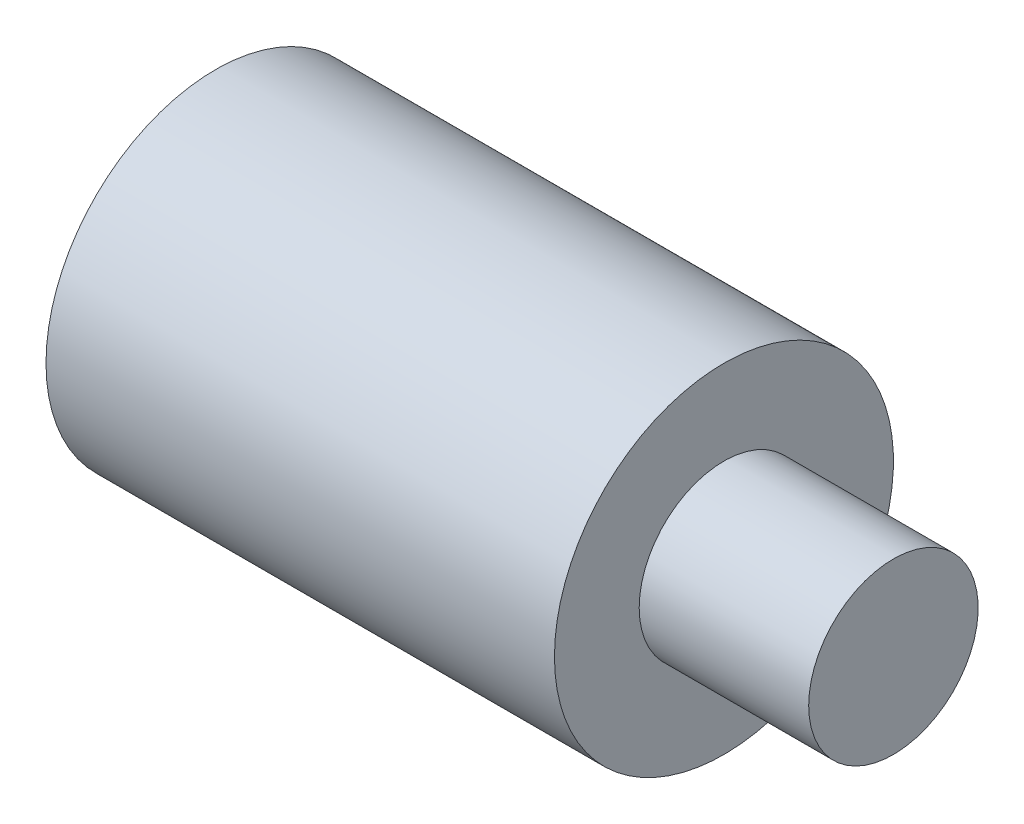
ISO-10303-21;
HEADER;
FILE_DESCRIPTION(('STEP AP214'),'2;1');
FILE_NAME('part.step','',(''),(''),'','','');
FILE_SCHEMA(('AUTOMOTIVE_DESIGN { 1 0 10303 214 1 1 1 1 }'));
ENDSEC;
DATA;
#1=APPLICATION_CONTEXT('core data for automotive mechanical design processes');
#2=APPLICATION_PROTOCOL_DEFINITION('international standard','automotive_design',2000,#1);
#3=PRODUCT_CONTEXT('',#1,'mechanical');
#4=PRODUCT('Part','Part','',(#3));
#5=PRODUCT_RELATED_PRODUCT_CATEGORY('part','',(#4));
#6=PRODUCT_DEFINITION_FORMATION('','',#4);
#7=PRODUCT_DEFINITION_CONTEXT('part definition',#1,'design');
#8=PRODUCT_DEFINITION('design','',#6,#7);
#9=PRODUCT_DEFINITION_SHAPE('','',#8);
#10=(LENGTH_UNIT() NAMED_UNIT(*) SI_UNIT(.MILLI.,.METRE.));
#11=(NAMED_UNIT(*) PLANE_ANGLE_UNIT() SI_UNIT($,.RADIAN.));
#12=(NAMED_UNIT(*) SI_UNIT($,.STERADIAN.) SOLID_ANGLE_UNIT());
#13=UNCERTAINTY_MEASURE_WITH_UNIT(LENGTH_MEASURE(1.E-05),#10,'distance_accuracy_value','');
#14=(GEOMETRIC_REPRESENTATION_CONTEXT(3) GLOBAL_UNCERTAINTY_ASSIGNED_CONTEXT((#13)) GLOBAL_UNIT_ASSIGNED_CONTEXT((#10,
#11,#12)) REPRESENTATION_CONTEXT('',''));
#15=CARTESIAN_POINT('',(0.,0.,0.));
#16=DIRECTION('',(0.,0.,1.));
#17=DIRECTION('',(1.,0.,0.));
#18=AXIS2_PLACEMENT_3D('',#15,#16,#17);
#19=CARTESIAN_POINT('',(25.4,3.175,0.));
#20=DIRECTION('',(-1.,0.,0.));
#21=DIRECTION('',(0.,0.,1.));
#22=AXIS2_PLACEMENT_3D('',#19,#20,#21);
#23=PLANE('',#22);
#24=CARTESIAN_POINT('',(25.4,0.,0.));
#25=DIRECTION('',(-1.,0.,0.));
#26=DIRECTION('',(0.,0.,1.));
#27=AXIS2_PLACEMENT_3D('',#24,#25,#26);
#28=CIRCLE('',#27,3.175);
#29=CARTESIAN_POINT('',(25.4,0.,3.175));
#30=VERTEX_POINT('',#29);
#31=EDGE_CURVE('E54',#30,#30,#28,.T.);
#32=ORIENTED_EDGE('',*,*,#31,.F.);
#33=EDGE_LOOP('',(#32));
#34=FACE_BOUND('',#33,.T.);
#35=ADVANCED_FACE('F37',(#34),#23,.F.);
#36=CARTESIAN_POINT('',(0.,0.,0.));
#37=DIRECTION('',(1.,0.,0.));
#38=DIRECTION('',(0.,0.,-1.));
#39=AXIS2_PLACEMENT_3D('',#36,#37,#38);
#40=PLANE('',#39);
#41=CARTESIAN_POINT('',(0.,0.,0.));
#42=DIRECTION('',(-1.,0.,0.));
#43=DIRECTION('',(0.,0.,1.));
#44=AXIS2_PLACEMENT_3D('',#41,#42,#43);
#45=CIRCLE('',#44,6.35);
#46=CARTESIAN_POINT('',(0.,0.,6.35));
#47=VERTEX_POINT('',#46);
#48=EDGE_CURVE('E10',#47,#47,#45,.T.);
#49=ORIENTED_EDGE('',*,*,#48,.T.);
#50=EDGE_LOOP('',(#49));
#51=FACE_BOUND('',#50,.T.);
#52=ADVANCED_FACE('F64',(#51),#40,.F.);
#53=CARTESIAN_POINT('',(-27.5667009249743,0.,0.));
#54=DIRECTION('',(-1.,0.,0.));
#55=DIRECTION('',(0.,0.,1.));
#56=AXIS2_PLACEMENT_3D('',#53,#54,#55);
#57=CYLINDRICAL_SURFACE('',#56,6.35);
#58=ORIENTED_EDGE('',*,*,#48,.F.);
#59=EDGE_LOOP('',(#58));
#60=FACE_BOUND('',#59,.T.);
#61=CARTESIAN_POINT('',(19.05,0.,0.));
#62=DIRECTION('',(-1.,0.,0.));
#63=DIRECTION('',(0.,0.,1.));
#64=AXIS2_PLACEMENT_3D('',#61,#62,#63);
#65=CIRCLE('',#64,6.35);
#66=CARTESIAN_POINT('',(19.05,0.,6.35));
#67=VERTEX_POINT('',#66);
#68=EDGE_CURVE('E44',#67,#67,#65,.T.);
#69=ORIENTED_EDGE('',*,*,#68,.T.);
#70=EDGE_LOOP('',(#69));
#71=FACE_BOUND('',#70,.T.);
#72=ADVANCED_FACE('F68',(#60,#71),#57,.T.);
#73=CARTESIAN_POINT('',(19.05,6.35,0.));
#74=DIRECTION('',(-1.,0.,0.));
#75=DIRECTION('',(0.,0.,1.));
#76=AXIS2_PLACEMENT_3D('',#73,#74,#75);
#77=PLANE('',#76);
#78=ORIENTED_EDGE('',*,*,#68,.F.);
#79=EDGE_LOOP('',(#78));
#80=FACE_BOUND('',#79,.T.);
#81=CARTESIAN_POINT('',(19.05,0.,0.));
#82=DIRECTION('',(-1.,0.,0.));
#83=DIRECTION('',(0.,0.,1.));
#84=AXIS2_PLACEMENT_3D('',#81,#82,#83);
#85=CIRCLE('',#84,3.175);
#86=CARTESIAN_POINT('',(19.05,0.,3.175));
#87=VERTEX_POINT('',#86);
#88=EDGE_CURVE('E49',#87,#87,#85,.T.);
#89=ORIENTED_EDGE('',*,*,#88,.T.);
#90=EDGE_LOOP('',(#89));
#91=FACE_BOUND('',#90,.T.);
#92=ADVANCED_FACE('F72',(#80,#91),#77,.F.);
#93=CARTESIAN_POINT('',(-27.5667009249743,0.,0.));
#94=DIRECTION('',(-1.,0.,0.));
#95=DIRECTION('',(0.,0.,1.));
#96=AXIS2_PLACEMENT_3D('',#93,#94,#95);
#97=CYLINDRICAL_SURFACE('',#96,3.175);
#98=ORIENTED_EDGE('',*,*,#88,.F.);
#99=EDGE_LOOP('',(#98));
#100=FACE_BOUND('',#99,.T.);
#101=ORIENTED_EDGE('',*,*,#31,.T.);
#102=EDGE_LOOP('',(#101));
#103=FACE_BOUND('',#102,.T.);
#104=ADVANCED_FACE('F61',(#100,#103),#97,.T.);
#105=CLOSED_SHELL('',(#35,#52,#72,#92,#104));
#106=MANIFOLD_SOLID_BREP('B2',#105);
#107=ADVANCED_BREP_SHAPE_REPRESENTATION('',(#18,#106),#14);
#108=SHAPE_DEFINITION_REPRESENTATION(#9,#107);
ENDSEC;
END-ISO-10303-21;
